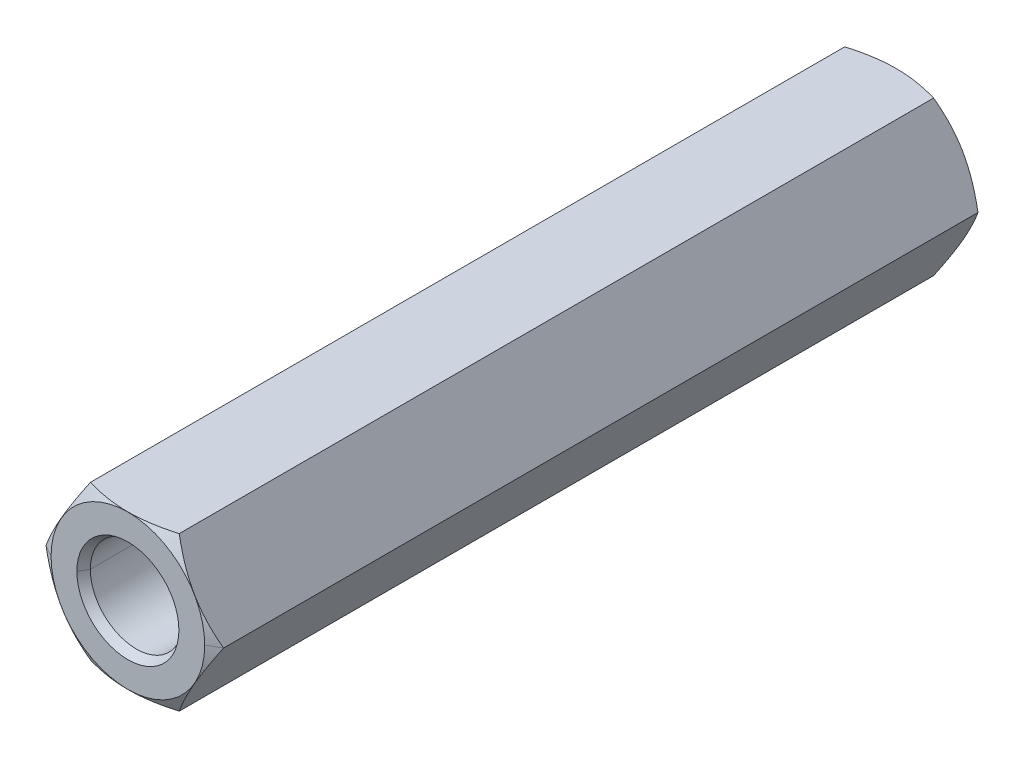
ISO-10303-21;
HEADER;
FILE_DESCRIPTION(('STEP AP214'),'2;1');
FILE_NAME('part.step','',(''),(''),'','','');
FILE_SCHEMA(('AUTOMOTIVE_DESIGN { 1 0 10303 214 1 1 1 1 }'));
ENDSEC;
DATA;
#1=APPLICATION_CONTEXT('core data for automotive mechanical design processes');
#2=APPLICATION_PROTOCOL_DEFINITION('international standard','automotive_design',2000,#1);
#3=PRODUCT_CONTEXT('',#1,'mechanical');
#4=PRODUCT('Part','Part','',(#3));
#5=PRODUCT_RELATED_PRODUCT_CATEGORY('part','',(#4));
#6=PRODUCT_DEFINITION_FORMATION('','',#4);
#7=PRODUCT_DEFINITION_CONTEXT('part definition',#1,'design');
#8=PRODUCT_DEFINITION('design','',#6,#7);
#9=PRODUCT_DEFINITION_SHAPE('','',#8);
#10=(LENGTH_UNIT() NAMED_UNIT(*) SI_UNIT(.MILLI.,.METRE.));
#11=(NAMED_UNIT(*) PLANE_ANGLE_UNIT() SI_UNIT($,.RADIAN.));
#12=(NAMED_UNIT(*) SI_UNIT($,.STERADIAN.) SOLID_ANGLE_UNIT());
#13=UNCERTAINTY_MEASURE_WITH_UNIT(LENGTH_MEASURE(1.E-05),#10,'distance_accuracy_value','');
#14=(GEOMETRIC_REPRESENTATION_CONTEXT(3) GLOBAL_UNCERTAINTY_ASSIGNED_CONTEXT((#13)) GLOBAL_UNIT_ASSIGNED_CONTEXT((#10,
#11,#12)) REPRESENTATION_CONTEXT('',''));
#15=CARTESIAN_POINT('',(0.,0.,0.));
#16=DIRECTION('',(0.,0.,1.));
#17=DIRECTION('',(1.,0.,0.));
#18=AXIS2_PLACEMENT_3D('',#15,#16,#17);
#19=CARTESIAN_POINT('',(116.318744279938,82.5620432923505,125.715557504815));
#20=DIRECTION('',(0.,0.,1.));
#21=DIRECTION('',(-1.,0.,0.));
#22=AXIS2_PLACEMENT_3D('',#19,#20,#21);
#23=CONICAL_SURFACE('',#22,1.73205080757048,1.047197551197);
#24=DIRECTION('',(-0.86602540378464,0.,0.499999999999652));
#25=VECTOR('',#24,1.);
#26=CARTESIAN_POINT('',(114.586693472367,82.5620432923505,125.715557504815));
#27=LINE('',#26,#25);
#28=CARTESIAN_POINT('',(116.318744279938,82.5620432923505,124.715557504815));
#29=VERTEX_POINT('',#28);
#30=CARTESIAN_POINT('',(114.818744279938,82.5620432923505,125.581582908599));
#31=VERTEX_POINT('',#30);
#32=EDGE_CURVE('E67',#29,#31,#27,.T.);
#33=ORIENTED_EDGE('',*,*,#32,.F.);
#34=DIRECTION('',(0.86602540378464,0.,0.499999999999652));
#35=VECTOR('',#34,1.);
#36=CARTESIAN_POINT('',(118.050795087508,82.5620432923505,125.715557504815));
#37=LINE('',#36,#35);
#38=CARTESIAN_POINT('',(117.818744279938,82.5620432923505,125.581582908599));
#39=VERTEX_POINT('',#38);
#40=EDGE_CURVE('E11',#29,#39,#37,.T.);
#41=ORIENTED_EDGE('',*,*,#40,.T.);
#42=CARTESIAN_POINT('',(116.318744279938,82.5620432923505,125.581582908599));
#43=DIRECTION('',(0.,0.,-1.));
#44=DIRECTION('',(-1.,0.,0.));
#45=AXIS2_PLACEMENT_3D('',#42,#43,#44);
#46=CIRCLE('',#45,1.5);
#47=EDGE_CURVE('E55',#31,#39,#46,.T.);
#48=ORIENTED_EDGE('',*,*,#47,.F.);
#49=EDGE_LOOP('',(#33,#41,#48));
#50=FACE_BOUND('',#49,.T.);
#51=ADVANCED_FACE('F44',(#50),#23,.F.);
#52=CARTESIAN_POINT('',(116.318744279938,82.5620432923505,125.581582908599));
#53=DIRECTION('',(0.,0.,1.));
#54=DIRECTION('',(-1.,0.,0.));
#55=AXIS2_PLACEMENT_3D('',#52,#53,#54);
#56=CYLINDRICAL_SURFACE('',#55,1.5);
#57=ORIENTED_EDGE('',*,*,#47,.T.);
#58=DIRECTION('',(0.,0.,1.));
#59=VECTOR('',#58,1.);
#60=CARTESIAN_POINT('',(117.818744279938,82.5620432923505,125.581582908599));
#61=LINE('',#60,#59);
#62=CARTESIAN_POINT('',(117.818744279938,82.5620432923505,135.304454779389));
#63=VERTEX_POINT('',#62);
#64=EDGE_CURVE('E209',#39,#63,#61,.T.);
#65=ORIENTED_EDGE('',*,*,#64,.T.);
#66=CARTESIAN_POINT('',(116.318744279938,82.5620432923505,135.304454779389));
#67=DIRECTION('',(0.,0.,-1.));
#68=DIRECTION('',(-1.,0.,0.));
#69=AXIS2_PLACEMENT_3D('',#66,#67,#68);
#70=CIRCLE('',#69,1.5);
#71=CARTESIAN_POINT('',(114.818744279938,82.5620432923505,135.304454779389));
#72=VERTEX_POINT('',#71);
#73=EDGE_CURVE('E187',#72,#63,#70,.T.);
#74=ORIENTED_EDGE('',*,*,#73,.F.);
#75=DIRECTION('',(0.,0.,1.));
#76=VECTOR('',#75,1.);
#77=CARTESIAN_POINT('',(114.818744279938,82.5620432923505,125.581582908599));
#78=LINE('',#77,#76);
#79=EDGE_CURVE('E277',#31,#72,#78,.T.);
#80=ORIENTED_EDGE('',*,*,#79,.F.);
#81=EDGE_LOOP('',(#57,#65,#74,#80));
#82=FACE_BOUND('',#81,.T.);
#83=ADVANCED_FACE('F466',(#82),#56,.F.);
#84=CARTESIAN_POINT('',(116.318744279938,82.5620432923505,135.304454779389));
#85=DIRECTION('',(0.,0.,1.));
#86=DIRECTION('',(-1.,0.,0.));
#87=AXIS2_PLACEMENT_3D('',#84,#85,#86);
#88=CONICAL_SURFACE('',#87,1.5,0.5235987756);
#89=ORIENTED_EDGE('',*,*,#73,.T.);
#90=DIRECTION('',(0.500000000001473,0.,0.866025403783588));
#91=VECTOR('',#90,1.);
#92=CARTESIAN_POINT('',(117.818744279938,82.5620432923505,135.304454779389));
#93=LINE('',#92,#91);
#94=CARTESIAN_POINT('',(117.978744279938,82.5620432923505,135.581582908599));
#95=VERTEX_POINT('',#94);
#96=EDGE_CURVE('E184',#63,#95,#93,.T.);
#97=ORIENTED_EDGE('',*,*,#96,.T.);
#98=CARTESIAN_POINT('',(116.318744279938,82.5620432923505,135.581582908599));
#99=DIRECTION('',(0.,0.,-1.));
#100=DIRECTION('',(-1.,0.,0.));
#101=AXIS2_PLACEMENT_3D('',#98,#99,#100);
#102=CIRCLE('',#101,1.66);
#103=CARTESIAN_POINT('',(114.658744279938,82.5620432923505,135.581582908599));
#104=VERTEX_POINT('',#103);
#105=EDGE_CURVE('E173',#104,#95,#102,.T.);
#106=ORIENTED_EDGE('',*,*,#105,.F.);
#107=DIRECTION('',(-0.500000000001473,0.,0.866025403783588));
#108=VECTOR('',#107,1.);
#109=CARTESIAN_POINT('',(114.818744279938,82.5620432923505,135.304454779389));
#110=LINE('',#109,#108);
#111=EDGE_CURVE('E195',#72,#104,#110,.T.);
#112=ORIENTED_EDGE('',*,*,#111,.F.);
#113=EDGE_LOOP('',(#89,#97,#106,#112));
#114=FACE_BOUND('',#113,.T.);
#115=ADVANCED_FACE('F185',(#114),#88,.F.);
#116=CARTESIAN_POINT('',(116.318744279938,82.5620432923505,135.581582908599));
#117=DIRECTION('',(0.,0.,-1.));
#118=DIRECTION('',(-1.,0.,0.));
#119=AXIS2_PLACEMENT_3D('',#116,#117,#118);
#120=CONICAL_SURFACE('',#119,2.5,1.047197551197);
#121=CARTESIAN_POINT('',(116.318744279938,82.5620432923505,135.581582908599));
#122=DIRECTION('',(0.,0.,-1.));
#123=DIRECTION('',(-1.,0.,0.));
#124=AXIS2_PLACEMENT_3D('',#121,#122,#123);
#125=CIRCLE('',#124,2.5);
#126=CARTESIAN_POINT('',(113.818744279938,82.5620432923505,135.581582908599));
#127=VERTEX_POINT('',#126);
#128=CARTESIAN_POINT('',(118.818744279938,82.5620432923505,135.581582908599));
#129=VERTEX_POINT('',#128);
#130=EDGE_CURVE('E192',#127,#129,#125,.T.);
#131=ORIENTED_EDGE('',*,*,#130,.T.);
#132=DIRECTION('',(0.86602540378464,0.,-0.499999999999652));
#133=VECTOR('',#132,1.);
#134=CARTESIAN_POINT('',(118.818744279938,82.5620432923505,135.581582908599));
#135=LINE('',#134,#133);
#136=CARTESIAN_POINT('',(119.208744279938,82.5620432923505,135.356416303615));
#137=VERTEX_POINT('',#136);
#138=EDGE_CURVE('E301',#129,#137,#135,.T.);
#139=ORIENTED_EDGE('',*,*,#138,.T.);
#140=CARTESIAN_POINT('',(117.763744279938,85.0648567092876,135.356416303615));
#141=CARTESIAN_POINT('',(118.486244279938,83.8134500008194,135.773551873104));
#142=CARTESIAN_POINT('',(119.208744279938,82.5620432923505,135.356416303615));
#143=(BOUNDED_CURVE() B_SPLINE_CURVE(2,(#140,#141,#142),.UNSPECIFIED.,.F.,
.F.) B_SPLINE_CURVE_WITH_KNOTS((3,3),(0.,1.),
.UNSPECIFIED.) CURVE() GEOMETRIC_REPRESENTATION_ITEM() RATIONAL_B_SPLINE_CURVE((1.,
1.15470053837935,1.)) REPRESENTATION_ITEM(''));
#144=CARTESIAN_POINT('',(117.763744279938,85.0648567092876,135.356416303615));
#145=VERTEX_POINT('',#144);
#146=EDGE_CURVE('E276',#145,#137,#143,.T.);
#147=ORIENTED_EDGE('',*,*,#146,.F.);
#148=CARTESIAN_POINT('',(114.873744279938,85.0648567092876,135.356416303615));
#149=CARTESIAN_POINT('',(116.318744279938,85.0648567092875,135.773551873104));
#150=CARTESIAN_POINT('',(117.763744279938,85.0648567092876,135.356416303615));
#151=(BOUNDED_CURVE() B_SPLINE_CURVE(2,(#148,#149,#150),.UNSPECIFIED.,.F.,
.F.) B_SPLINE_CURVE_WITH_KNOTS((3,3),(0.,1.),
.UNSPECIFIED.) CURVE() GEOMETRIC_REPRESENTATION_ITEM() RATIONAL_B_SPLINE_CURVE((1.,
1.15470053837926,1.)) REPRESENTATION_ITEM(''));
#152=CARTESIAN_POINT('',(114.873744279938,85.0648567092876,135.356416303615));
#153=VERTEX_POINT('',#152);
#154=EDGE_CURVE('E316',#153,#145,#151,.T.);
#155=ORIENTED_EDGE('',*,*,#154,.F.);
#156=CARTESIAN_POINT('',(113.428744279938,82.5620432923505,135.356416303615));
#157=CARTESIAN_POINT('',(114.151244279937,83.8134500008189,135.773551873104));
#158=CARTESIAN_POINT('',(114.873744279938,85.0648567092876,135.356416303615));
#159=(BOUNDED_CURVE() B_SPLINE_CURVE(2,(#156,#157,#158),.UNSPECIFIED.,.F.,
.F.) B_SPLINE_CURVE_WITH_KNOTS((3,3),(0.,1.),
.UNSPECIFIED.) CURVE() GEOMETRIC_REPRESENTATION_ITEM() RATIONAL_B_SPLINE_CURVE((1.,
1.15470053837946,1.)) REPRESENTATION_ITEM(''));
#160=CARTESIAN_POINT('',(113.428744279938,82.5620432923505,135.356416303615));
#161=VERTEX_POINT('',#160);
#162=EDGE_CURVE('E259',#161,#153,#159,.T.);
#163=ORIENTED_EDGE('',*,*,#162,.F.);
#164=DIRECTION('',(-0.86602540378464,0.,-0.499999999999652));
#165=VECTOR('',#164,1.);
#166=CARTESIAN_POINT('',(113.818744279938,82.5620432923505,135.581582908599));
#167=LINE('',#166,#165);
#168=EDGE_CURVE('E181',#127,#161,#167,.T.);
#169=ORIENTED_EDGE('',*,*,#168,.F.);
#170=EDGE_LOOP('',(#131,#139,#147,#155,#163,#169));
#171=FACE_BOUND('',#170,.T.);
#172=ADVANCED_FACE('F512',(#171),#120,.T.);
#173=CARTESIAN_POINT('',(116.318744279938,82.5620432923505,110.806749513583));
#174=DIRECTION('',(0.,0.,1.));
#175=DIRECTION('',(-1.,0.,0.));
#176=AXIS2_PLACEMENT_3D('',#173,#174,#175);
#177=CONICAL_SURFACE('',#176,2.89,1.047197551197);
#178=CARTESIAN_POINT('',(116.318744279938,82.5620432923505,110.581582908599));
#179=DIRECTION('',(0.,0.,-1.));
#180=DIRECTION('',(-1.,0.,0.));
#181=AXIS2_PLACEMENT_3D('',#178,#179,#180);
#182=CIRCLE('',#181,2.5);
#183=CARTESIAN_POINT('',(118.818744279938,82.5620432923505,110.581582908599));
#184=VERTEX_POINT('',#183);
#185=CARTESIAN_POINT('',(113.818744279938,82.5620432923505,110.581582908599));
#186=VERTEX_POINT('',#185);
#187=EDGE_CURVE('E243',#184,#186,#182,.T.);
#188=ORIENTED_EDGE('',*,*,#187,.F.);
#189=DIRECTION('',(0.86602540378464,0.,0.499999999999652));
#190=VECTOR('',#189,1.);
#191=CARTESIAN_POINT('',(119.208744279938,82.5620432923505,110.806749513583));
#192=LINE('',#191,#190);
#193=CARTESIAN_POINT('',(119.208744279938,82.5620432923506,110.806749513583));
#194=VERTEX_POINT('',#193);
#195=EDGE_CURVE('E297',#184,#194,#192,.T.);
#196=ORIENTED_EDGE('',*,*,#195,.T.);
#197=CARTESIAN_POINT('',(117.763744279938,80.0592298754135,110.806749513583));
#198=CARTESIAN_POINT('',(118.486244279938,81.3106365838816,110.389613944093));
#199=CARTESIAN_POINT('',(119.208744279938,82.5620432923506,110.806749513583));
#200=(BOUNDED_CURVE() B_SPLINE_CURVE(2,(#197,#198,#199),.UNSPECIFIED.,.F.,
.F.) B_SPLINE_CURVE_WITH_KNOTS((3,3),(0.,1.),
.UNSPECIFIED.) CURVE() GEOMETRIC_REPRESENTATION_ITEM() RATIONAL_B_SPLINE_CURVE((1.,
1.15470053837936,1.)) REPRESENTATION_ITEM(''));
#201=CARTESIAN_POINT('',(117.763744279938,80.0592298754135,110.806749513583));
#202=VERTEX_POINT('',#201);
#203=EDGE_CURVE('E284',#202,#194,#200,.T.);
#204=ORIENTED_EDGE('',*,*,#203,.F.);
#205=CARTESIAN_POINT('',(114.873744279938,80.0592298754135,110.806749513583));
#206=CARTESIAN_POINT('',(116.318744279938,80.0592298754135,110.389613944093));
#207=CARTESIAN_POINT('',(117.763744279938,80.0592298754135,110.806749513583));
#208=(BOUNDED_CURVE() B_SPLINE_CURVE(2,(#205,#206,#207),.UNSPECIFIED.,.F.,
.F.) B_SPLINE_CURVE_WITH_KNOTS((3,3),(0.,1.),
.UNSPECIFIED.) CURVE() GEOMETRIC_REPRESENTATION_ITEM() RATIONAL_B_SPLINE_CURVE((1.,
1.15470053837925,1.)) REPRESENTATION_ITEM(''));
#209=CARTESIAN_POINT('',(114.873744279938,80.0592298754135,110.806749513583));
#210=VERTEX_POINT('',#209);
#211=EDGE_CURVE('E222',#210,#202,#208,.T.);
#212=ORIENTED_EDGE('',*,*,#211,.F.);
#213=CARTESIAN_POINT('',(113.428744279938,82.5620432923505,110.806749513583));
#214=CARTESIAN_POINT('',(114.151244279937,81.3106365838822,110.389613944093));
#215=CARTESIAN_POINT('',(114.873744279938,80.0592298754135,110.806749513583));
#216=(BOUNDED_CURVE() B_SPLINE_CURVE(2,(#213,#214,#215),.UNSPECIFIED.,.F.,
.F.) B_SPLINE_CURVE_WITH_KNOTS((3,3),(0.,1.),
.UNSPECIFIED.) CURVE() GEOMETRIC_REPRESENTATION_ITEM() RATIONAL_B_SPLINE_CURVE((1.,
1.15470053837944,1.)) REPRESENTATION_ITEM(''));
#217=CARTESIAN_POINT('',(113.428744279938,82.5620432923505,110.806749513583));
#218=VERTEX_POINT('',#217);
#219=EDGE_CURVE('E238',#218,#210,#216,.T.);
#220=ORIENTED_EDGE('',*,*,#219,.F.);
#221=DIRECTION('',(-0.86602540378464,0.,0.499999999999652));
#222=VECTOR('',#221,1.);
#223=CARTESIAN_POINT('',(113.428744279938,82.5620432923505,110.806749513583));
#224=LINE('',#223,#222);
#225=EDGE_CURVE('E237',#186,#218,#224,.T.);
#226=ORIENTED_EDGE('',*,*,#225,.F.);
#227=EDGE_LOOP('',(#188,#196,#204,#212,#220,#226));
#228=FACE_BOUND('',#227,.T.);
#229=ADVANCED_FACE('F500',(#228),#177,.T.);
#230=CARTESIAN_POINT('',(116.318744279938,82.5620432923505,110.581582908599));
#231=DIRECTION('',(0.,0.,-1.));
#232=DIRECTION('',(-1.,0.,0.));
#233=AXIS2_PLACEMENT_3D('',#230,#231,#232);
#234=CONICAL_SURFACE('',#233,1.65999999999899,0.523598775598);
#235=CARTESIAN_POINT('',(116.318744279938,82.5620432923505,110.858711037809));
#236=DIRECTION('',(0.,0.,-1.));
#237=DIRECTION('',(-1.,0.,0.));
#238=AXIS2_PLACEMENT_3D('',#235,#236,#237);
#239=CIRCLE('',#238,1.5);
#240=CARTESIAN_POINT('',(117.818744279938,82.5620432923505,110.858711037809));
#241=VERTEX_POINT('',#240);
#242=CARTESIAN_POINT('',(114.818744279938,82.5620432923505,110.858711037809));
#243=VERTEX_POINT('',#242);
#244=EDGE_CURVE('E253',#241,#243,#239,.T.);
#245=ORIENTED_EDGE('',*,*,#244,.F.);
#246=DIRECTION('',(0.499999999999741,0.,-0.866025403784588));
#247=VECTOR('',#246,1.);
#248=CARTESIAN_POINT('',(117.978744279937,82.5620432923505,110.581582908599));
#249=LINE('',#248,#247);
#250=CARTESIAN_POINT('',(117.978744279937,82.5620432923505,110.581582908599));
#251=VERTEX_POINT('',#250);
#252=EDGE_CURVE('E242',#241,#251,#249,.T.);
#253=ORIENTED_EDGE('',*,*,#252,.T.);
#254=CARTESIAN_POINT('',(116.318744279938,82.5620432923505,110.581582908599));
#255=DIRECTION('',(0.,0.,-1.));
#256=DIRECTION('',(-1.,0.,0.));
#257=AXIS2_PLACEMENT_3D('',#254,#255,#256);
#258=CIRCLE('',#257,1.65999999999899);
#259=CARTESIAN_POINT('',(114.658744279939,82.5620432923505,110.581582908599));
#260=VERTEX_POINT('',#259);
#261=EDGE_CURVE('E232',#251,#260,#258,.T.);
#262=ORIENTED_EDGE('',*,*,#261,.T.);
#263=DIRECTION('',(-0.499999999999741,0.,-0.866025403784588));
#264=VECTOR('',#263,1.);
#265=CARTESIAN_POINT('',(114.658744279939,82.5620432923505,110.581582908599));
#266=LINE('',#265,#264);
#267=EDGE_CURVE('E394',#243,#260,#266,.T.);
#268=ORIENTED_EDGE('',*,*,#267,.F.);
#269=EDGE_LOOP('',(#245,#253,#262,#268));
#270=FACE_BOUND('',#269,.T.);
#271=ADVANCED_FACE('F448',(#270),#234,.F.);
#272=CARTESIAN_POINT('',(116.318744279938,82.5620432923505,110.858711037809));
#273=DIRECTION('',(0.,0.,1.));
#274=DIRECTION('',(-1.,0.,0.));
#275=AXIS2_PLACEMENT_3D('',#272,#273,#274);
#276=CYLINDRICAL_SURFACE('',#275,1.5);
#277=CARTESIAN_POINT('',(116.318744279938,82.5620432923505,110.858711037809));
#278=DIRECTION('',(0.,0.,-1.));
#279=DIRECTION('',(-1.,0.,0.));
#280=AXIS2_PLACEMENT_3D('',#277,#278,#279);
#281=CIRCLE('',#280,1.5);
#282=EDGE_CURVE('E213',#243,#241,#281,.T.);
#283=ORIENTED_EDGE('',*,*,#282,.T.);
#284=DIRECTION('',(0.,0.,1.));
#285=VECTOR('',#284,1.);
#286=CARTESIAN_POINT('',(117.818744279938,82.5620432923505,110.858711037809));
#287=LINE('',#286,#285);
#288=CARTESIAN_POINT('',(117.818744279938,82.5620432923505,120.581582908599));
#289=VERTEX_POINT('',#288);
#290=EDGE_CURVE('E210',#241,#289,#287,.T.);
#291=ORIENTED_EDGE('',*,*,#290,.T.);
#292=CARTESIAN_POINT('',(116.318744279938,82.5620432923505,120.581582908599));
#293=DIRECTION('',(0.,0.,-1.));
#294=DIRECTION('',(-1.,0.,0.));
#295=AXIS2_PLACEMENT_3D('',#292,#293,#294);
#296=CIRCLE('',#295,1.5);
#297=CARTESIAN_POINT('',(114.818744279938,82.5620432923505,120.581582908599));
#298=VERTEX_POINT('',#297);
#299=EDGE_CURVE('E141',#298,#289,#296,.T.);
#300=ORIENTED_EDGE('',*,*,#299,.F.);
#301=DIRECTION('',(0.,0.,1.));
#302=VECTOR('',#301,1.);
#303=CARTESIAN_POINT('',(114.818744279938,82.5620432923505,110.858711037809));
#304=LINE('',#303,#302);
#305=EDGE_CURVE('E156',#243,#298,#304,.T.);
#306=ORIENTED_EDGE('',*,*,#305,.F.);
#307=EDGE_LOOP('',(#283,#291,#300,#306));
#308=FACE_BOUND('',#307,.T.);
#309=ADVANCED_FACE('F499',(#308),#276,.F.);
#310=CARTESIAN_POINT('',(116.318744279938,82.5620432923505,120.581582908599));
#311=DIRECTION('',(0.,0.,-1.));
#312=DIRECTION('',(-1.,0.,0.));
#313=AXIS2_PLACEMENT_3D('',#310,#311,#312);
#314=CONICAL_SURFACE('',#313,1.5,1.047197551197);
#315=DIRECTION('',(-0.86602540378464,0.,-0.499999999999652));
#316=VECTOR('',#315,1.);
#317=CARTESIAN_POINT('',(114.818744279938,82.5620432923505,120.581582908599));
#318=LINE('',#317,#316);
#319=CARTESIAN_POINT('',(116.318744279938,82.5620432923505,121.447608312384));
#320=VERTEX_POINT('',#319);
#321=EDGE_CURVE('E252',#320,#298,#318,.T.);
#322=ORIENTED_EDGE('',*,*,#321,.F.);
#323=DIRECTION('',(0.86602540378464,0.,-0.499999999999652));
#324=VECTOR('',#323,1.);
#325=CARTESIAN_POINT('',(117.818744279938,82.5620432923505,120.581582908599));
#326=LINE('',#325,#324);
#327=EDGE_CURVE('E214',#320,#289,#326,.T.);
#328=ORIENTED_EDGE('',*,*,#327,.T.);
#329=CARTESIAN_POINT('',(116.318744279938,82.5620432923505,120.581582908599));
#330=DIRECTION('',(0.,0.,-1.));
#331=DIRECTION('',(-1.,0.,0.));
#332=AXIS2_PLACEMENT_3D('',#329,#330,#331);
#333=CIRCLE('',#332,1.5);
#334=EDGE_CURVE('E48',#289,#298,#333,.T.);
#335=ORIENTED_EDGE('',*,*,#334,.T.);
#336=EDGE_LOOP('',(#322,#328,#335));
#337=FACE_BOUND('',#336,.T.);
#338=ADVANCED_FACE('F475',(#337),#314,.F.);
#339=CARTESIAN_POINT('',(116.318744279938,82.5620432923505,120.581582908599));
#340=DIRECTION('',(0.,0.,-1.));
#341=DIRECTION('',(-1.,0.,0.));
#342=AXIS2_PLACEMENT_3D('',#339,#340,#341);
#343=CONICAL_SURFACE('',#342,1.5,1.047197551197);
#344=ORIENTED_EDGE('',*,*,#327,.F.);
#345=ORIENTED_EDGE('',*,*,#321,.T.);
#346=ORIENTED_EDGE('',*,*,#299,.T.);
#347=EDGE_LOOP('',(#344,#345,#346));
#348=FACE_BOUND('',#347,.T.);
#349=ADVANCED_FACE('F491',(#348),#343,.F.);
#350=CARTESIAN_POINT('',(116.318744279938,82.5620432923505,110.858711037809));
#351=DIRECTION('',(0.,0.,1.));
#352=DIRECTION('',(-1.,0.,0.));
#353=AXIS2_PLACEMENT_3D('',#350,#351,#352);
#354=CYLINDRICAL_SURFACE('',#353,1.5);
#355=ORIENTED_EDGE('',*,*,#290,.F.);
#356=ORIENTED_EDGE('',*,*,#244,.T.);
#357=ORIENTED_EDGE('',*,*,#305,.T.);
#358=ORIENTED_EDGE('',*,*,#334,.F.);
#359=EDGE_LOOP('',(#355,#356,#357,#358));
#360=FACE_BOUND('',#359,.T.);
#361=ADVANCED_FACE('F462',(#360),#354,.F.);
#362=CARTESIAN_POINT('',(116.318744279938,82.5620432923505,110.581582908599));
#363=DIRECTION('',(0.,0.,-1.));
#364=DIRECTION('',(-1.,0.,0.));
#365=AXIS2_PLACEMENT_3D('',#362,#363,#364);
#366=CONICAL_SURFACE('',#365,1.65999999999899,0.523598775598);
#367=ORIENTED_EDGE('',*,*,#252,.F.);
#368=ORIENTED_EDGE('',*,*,#282,.F.);
#369=ORIENTED_EDGE('',*,*,#267,.T.);
#370=CARTESIAN_POINT('',(116.318744279938,82.5620432923505,110.581582908599));
#371=DIRECTION('',(0.,0.,-1.));
#372=DIRECTION('',(-1.,0.,0.));
#373=AXIS2_PLACEMENT_3D('',#370,#371,#372);
#374=CIRCLE('',#373,1.65999999999899);
#375=EDGE_CURVE('E366',#260,#251,#374,.T.);
#376=ORIENTED_EDGE('',*,*,#375,.T.);
#377=EDGE_LOOP('',(#367,#368,#369,#376));
#378=FACE_BOUND('',#377,.T.);
#379=ADVANCED_FACE('F443',(#378),#366,.F.);
#380=CARTESIAN_POINT('',(116.318744279938,82.5620432923505,110.581582908599));
#381=DIRECTION('',(0.,0.,-1.));
#382=DIRECTION('',(0.,-1.,0.));
#383=AXIS2_PLACEMENT_3D('',#380,#381,#382);
#384=PLANE('',#383);
#385=CARTESIAN_POINT('',(116.318744279938,82.5620432923505,110.581582908599));
#386=DIRECTION('',(0.,0.,-1.));
#387=DIRECTION('',(-1.,0.,0.));
#388=AXIS2_PLACEMENT_3D('',#385,#386,#387);
#389=CIRCLE('',#388,2.5);
#390=EDGE_CURVE('E247',#186,#184,#389,.T.);
#391=ORIENTED_EDGE('',*,*,#390,.T.);
#392=ORIENTED_EDGE('',*,*,#187,.T.);
#393=EDGE_LOOP('',(#391,#392));
#394=FACE_BOUND('',#393,.T.);
#395=ORIENTED_EDGE('',*,*,#375,.F.);
#396=ORIENTED_EDGE('',*,*,#261,.F.);
#397=EDGE_LOOP('',(#395,#396));
#398=FACE_BOUND('',#397,.T.);
#399=ADVANCED_FACE('F450',(#394,#398),#384,.T.);
#400=CARTESIAN_POINT('',(116.318744279938,82.5620432923505,110.806749513583));
#401=DIRECTION('',(0.,0.,1.));
#402=DIRECTION('',(-1.,0.,0.));
#403=AXIS2_PLACEMENT_3D('',#400,#401,#402);
#404=CONICAL_SURFACE('',#403,2.89,1.047197551197);
#405=ORIENTED_EDGE('',*,*,#195,.F.);
#406=ORIENTED_EDGE('',*,*,#390,.F.);
#407=ORIENTED_EDGE('',*,*,#225,.T.);
#408=CARTESIAN_POINT('',(114.873744279938,85.0648567092876,110.806749513583));
#409=CARTESIAN_POINT('',(114.151244279938,83.8134500008194,110.389613944093));
#410=CARTESIAN_POINT('',(113.428744279938,82.5620432923505,110.806749513583));
#411=(BOUNDED_CURVE() B_SPLINE_CURVE(2,(#408,#409,#410),.UNSPECIFIED.,.F.,
.F.) B_SPLINE_CURVE_WITH_KNOTS((3,3),(0.,1.),
.UNSPECIFIED.) CURVE() GEOMETRIC_REPRESENTATION_ITEM() RATIONAL_B_SPLINE_CURVE((1.,
1.15470053837935,1.)) REPRESENTATION_ITEM(''));
#412=CARTESIAN_POINT('',(114.873744279938,85.0648567092876,110.806749513583));
#413=VERTEX_POINT('',#412);
#414=EDGE_CURVE('E264',#413,#218,#411,.T.);
#415=ORIENTED_EDGE('',*,*,#414,.F.);
#416=CARTESIAN_POINT('',(117.763744279938,85.0648567092876,110.806749513583));
#417=CARTESIAN_POINT('',(116.318744279938,85.0648567092875,110.389613944093));
#418=CARTESIAN_POINT('',(114.873744279938,85.0648567092876,110.806749513583));
#419=(BOUNDED_CURVE() B_SPLINE_CURVE(2,(#416,#417,#418),.UNSPECIFIED.,.F.,
.F.) B_SPLINE_CURVE_WITH_KNOTS((3,3),(0.,1.),
.UNSPECIFIED.) CURVE() GEOMETRIC_REPRESENTATION_ITEM() RATIONAL_B_SPLINE_CURVE((1.,
1.15470053837925,1.)) REPRESENTATION_ITEM(''));
#420=CARTESIAN_POINT('',(117.763744279938,85.0648567092876,110.806749513583));
#421=VERTEX_POINT('',#420);
#422=EDGE_CURVE('E322',#421,#413,#419,.T.);
#423=ORIENTED_EDGE('',*,*,#422,.F.);
#424=CARTESIAN_POINT('',(119.208744279938,82.5620432923506,110.806749513583));
#425=CARTESIAN_POINT('',(118.486244279938,83.8134500008189,110.389613944093));
#426=CARTESIAN_POINT('',(117.763744279938,85.0648567092876,110.806749513583));
#427=(BOUNDED_CURVE() B_SPLINE_CURVE(2,(#424,#425,#426),.UNSPECIFIED.,.F.,
.F.) B_SPLINE_CURVE_WITH_KNOTS((3,3),(0.,1.),
.UNSPECIFIED.) CURVE() GEOMETRIC_REPRESENTATION_ITEM() RATIONAL_B_SPLINE_CURVE((1.,
1.15470053837944,1.)) REPRESENTATION_ITEM(''));
#428=EDGE_CURVE('E266',#194,#421,#427,.T.);
#429=ORIENTED_EDGE('',*,*,#428,.F.);
#430=EDGE_LOOP('',(#405,#406,#407,#415,#423,#429));
#431=FACE_BOUND('',#430,.T.);
#432=ADVANCED_FACE('F452',(#431),#404,.T.);
#433=CARTESIAN_POINT('',(114.873744279938,80.0592298754135,135.581582908599));
#434=DIRECTION('',(0.866025403784329,0.50000000000019,0.));
#435=DIRECTION('',(0.,0.,-1.));
#436=AXIS2_PLACEMENT_3D('',#433,#434,#435);
#437=PLANE('',#436);
#438=DIRECTION('',(0.,0.,-1.));
#439=VECTOR('',#438,1.);
#440=CARTESIAN_POINT('',(113.428744279938,82.5620432923505,135.356416303615));
#441=LINE('',#440,#439);
#442=EDGE_CURVE('E233',#161,#218,#441,.T.);
#443=ORIENTED_EDGE('',*,*,#442,.T.);
#444=ORIENTED_EDGE('',*,*,#219,.T.);
#445=DIRECTION('',(0.,0.,-1.));
#446=VECTOR('',#445,1.);
#447=CARTESIAN_POINT('',(114.873744279938,80.0592298754135,135.581582908599));
#448=LINE('',#447,#446);
#449=CARTESIAN_POINT('',(114.873744279938,80.0592298754135,135.356416303615));
#450=VERTEX_POINT('',#449);
#451=EDGE_CURVE('E254',#450,#210,#448,.T.);
#452=ORIENTED_EDGE('',*,*,#451,.F.);
#453=CARTESIAN_POINT('',(114.873744279938,80.0592298754135,135.356416303615));
#454=CARTESIAN_POINT('',(114.151244279938,81.3106365838817,135.773551873104));
#455=CARTESIAN_POINT('',(113.428744279938,82.5620432923505,135.356416303615));
#456=(BOUNDED_CURVE() B_SPLINE_CURVE(2,(#453,#454,#455),.UNSPECIFIED.,.F.,
.F.) B_SPLINE_CURVE_WITH_KNOTS((3,3),(0.,1.),
.UNSPECIFIED.) CURVE() GEOMETRIC_REPRESENTATION_ITEM() RATIONAL_B_SPLINE_CURVE((1.,
1.15470053837935,1.)) REPRESENTATION_ITEM(''));
#457=EDGE_CURVE('E258',#450,#161,#456,.T.);
#458=ORIENTED_EDGE('',*,*,#457,.T.);
#459=EDGE_LOOP('',(#443,#444,#452,#458));
#460=FACE_BOUND('',#459,.T.);
#461=ADVANCED_FACE('F459',(#460),#437,.F.);
#462=CARTESIAN_POINT('',(117.763744279938,80.0592298754135,135.581582908599));
#463=DIRECTION('',(0.,1.,0.));
#464=DIRECTION('',(1.,0.,0.));
#465=AXIS2_PLACEMENT_3D('',#462,#463,#464);
#466=PLANE('',#465);
#467=ORIENTED_EDGE('',*,*,#451,.T.);
#468=ORIENTED_EDGE('',*,*,#211,.T.);
#469=DIRECTION('',(0.,0.,-1.));
#470=VECTOR('',#469,1.);
#471=CARTESIAN_POINT('',(117.763744279938,80.0592298754135,135.581582908599));
#472=LINE('',#471,#470);
#473=CARTESIAN_POINT('',(117.763744279938,80.0592298754135,135.356416303615));
#474=VERTEX_POINT('',#473);
#475=EDGE_CURVE('E223',#474,#202,#472,.T.);
#476=ORIENTED_EDGE('',*,*,#475,.F.);
#477=CARTESIAN_POINT('',(117.763744279938,80.0592298754135,135.356416303615));
#478=CARTESIAN_POINT('',(116.318744279938,80.0592298754135,135.773551873104));
#479=CARTESIAN_POINT('',(114.873744279938,80.0592298754135,135.356416303615));
#480=(BOUNDED_CURVE() B_SPLINE_CURVE(2,(#477,#478,#479),.UNSPECIFIED.,.F.,
.F.) B_SPLINE_CURVE_WITH_KNOTS((3,3),(0.,1.),
.UNSPECIFIED.) CURVE() GEOMETRIC_REPRESENTATION_ITEM() RATIONAL_B_SPLINE_CURVE((1.,
1.15470053837926,1.)) REPRESENTATION_ITEM(''));
#481=EDGE_CURVE('E216',#474,#450,#480,.T.);
#482=ORIENTED_EDGE('',*,*,#481,.T.);
#483=EDGE_LOOP('',(#467,#468,#476,#482));
#484=FACE_BOUND('',#483,.T.);
#485=ADVANCED_FACE('F485',(#484),#466,.F.);
#486=CARTESIAN_POINT('',(119.208744279938,82.5620432923505,135.581582908599));
#487=DIRECTION('',(-0.866025403784329,0.50000000000019,0.));
#488=DIRECTION('',(0.,0.,1.));
#489=AXIS2_PLACEMENT_3D('',#486,#487,#488);
#490=PLANE('',#489);
#491=ORIENTED_EDGE('',*,*,#475,.T.);
#492=ORIENTED_EDGE('',*,*,#203,.T.);
#493=DIRECTION('',(0.,0.,-1.));
#494=VECTOR('',#493,1.);
#495=CARTESIAN_POINT('',(119.208744279938,82.5620432923505,135.581582908599));
#496=LINE('',#495,#494);
#497=EDGE_CURVE('E275',#137,#194,#496,.T.);
#498=ORIENTED_EDGE('',*,*,#497,.F.);
#499=CARTESIAN_POINT('',(119.208744279938,82.5620432923505,135.356416303615));
#500=CARTESIAN_POINT('',(118.486244279938,81.3106365838822,135.773551873105));
#501=CARTESIAN_POINT('',(117.763744279938,80.0592298754135,135.356416303615));
#502=(BOUNDED_CURVE() B_SPLINE_CURVE(2,(#499,#500,#501),.UNSPECIFIED.,.F.,
.F.) B_SPLINE_CURVE_WITH_KNOTS((3,3),(0.,1.),
.UNSPECIFIED.) CURVE() GEOMETRIC_REPRESENTATION_ITEM() RATIONAL_B_SPLINE_CURVE((1.,
1.15470053837945,1.)) REPRESENTATION_ITEM(''));
#503=EDGE_CURVE('E290',#137,#474,#502,.T.);
#504=ORIENTED_EDGE('',*,*,#503,.T.);
#505=EDGE_LOOP('',(#491,#492,#498,#504));
#506=FACE_BOUND('',#505,.T.);
#507=ADVANCED_FACE('F481',(#506),#490,.F.);
#508=CARTESIAN_POINT('',(117.763744279938,85.0648567092876,135.581582908599));
#509=DIRECTION('',(-0.866025403784329,-0.50000000000019,0.));
#510=DIRECTION('',(-0.50000000000019,0.866025403784329,0.));
#511=AXIS2_PLACEMENT_3D('',#508,#509,#510);
#512=PLANE('',#511);
#513=ORIENTED_EDGE('',*,*,#497,.T.);
#514=ORIENTED_EDGE('',*,*,#428,.T.);
#515=DIRECTION('',(0.,0.,-1.));
#516=VECTOR('',#515,1.);
#517=CARTESIAN_POINT('',(117.763744279938,85.0648567092876,135.581582908599));
#518=LINE('',#517,#516);
#519=EDGE_CURVE('E359',#145,#421,#518,.T.);
#520=ORIENTED_EDGE('',*,*,#519,.F.);
#521=ORIENTED_EDGE('',*,*,#146,.T.);
#522=EDGE_LOOP('',(#513,#514,#520,#521));
#523=FACE_BOUND('',#522,.T.);
#524=ADVANCED_FACE('F484',(#523),#512,.F.);
#525=CARTESIAN_POINT('',(114.873744279938,85.0648567092876,135.581582908599));
#526=DIRECTION('',(0.,-1.,0.));
#527=DIRECTION('',(0.,0.,-1.));
#528=AXIS2_PLACEMENT_3D('',#525,#526,#527);
#529=PLANE('',#528);
#530=ORIENTED_EDGE('',*,*,#519,.T.);
#531=ORIENTED_EDGE('',*,*,#422,.T.);
#532=DIRECTION('',(0.,0.,-1.));
#533=VECTOR('',#532,1.);
#534=CARTESIAN_POINT('',(114.873744279938,85.0648567092876,135.581582908599));
#535=LINE('',#534,#533);
#536=EDGE_CURVE('E323',#153,#413,#535,.T.);
#537=ORIENTED_EDGE('',*,*,#536,.F.);
#538=ORIENTED_EDGE('',*,*,#154,.T.);
#539=EDGE_LOOP('',(#530,#531,#537,#538));
#540=FACE_BOUND('',#539,.T.);
#541=ADVANCED_FACE('F46',(#540),#529,.F.);
#542=CARTESIAN_POINT('',(113.428744279938,82.5620432923505,135.581582908599));
#543=DIRECTION('',(0.866025403784329,-0.50000000000019,0.));
#544=DIRECTION('',(0.,0.,-1.));
#545=AXIS2_PLACEMENT_3D('',#542,#543,#544);
#546=PLANE('',#545);
#547=ORIENTED_EDGE('',*,*,#536,.T.);
#548=ORIENTED_EDGE('',*,*,#414,.T.);
#549=ORIENTED_EDGE('',*,*,#442,.F.);
#550=ORIENTED_EDGE('',*,*,#162,.T.);
#551=EDGE_LOOP('',(#547,#548,#549,#550));
#552=FACE_BOUND('',#551,.T.);
#553=ADVANCED_FACE('F477',(#552),#546,.F.);
#554=CARTESIAN_POINT('',(116.318744279938,82.5620432923505,135.581582908599));
#555=DIRECTION('',(0.,0.,-1.));
#556=DIRECTION('',(-1.,0.,0.));
#557=AXIS2_PLACEMENT_3D('',#554,#555,#556);
#558=CONICAL_SURFACE('',#557,2.5,1.047197551197);
#559=ORIENTED_EDGE('',*,*,#138,.F.);
#560=CARTESIAN_POINT('',(116.318744279938,82.5620432923505,135.581582908599));
#561=DIRECTION('',(0.,0.,-1.));
#562=DIRECTION('',(-1.,0.,0.));
#563=AXIS2_PLACEMENT_3D('',#560,#561,#562);
#564=CIRCLE('',#563,2.5);
#565=EDGE_CURVE('E265',#129,#127,#564,.T.);
#566=ORIENTED_EDGE('',*,*,#565,.T.);
#567=ORIENTED_EDGE('',*,*,#168,.T.);
#568=ORIENTED_EDGE('',*,*,#457,.F.);
#569=ORIENTED_EDGE('',*,*,#481,.F.);
#570=ORIENTED_EDGE('',*,*,#503,.F.);
#571=EDGE_LOOP('',(#559,#566,#567,#568,#569,#570));
#572=FACE_BOUND('',#571,.T.);
#573=ADVANCED_FACE('F480',(#572),#558,.T.);
#574=CARTESIAN_POINT('',(116.318744279938,82.5620432923505,135.581582908599));
#575=DIRECTION('',(0.,0.,-1.));
#576=DIRECTION('',(0.,-1.,0.));
#577=AXIS2_PLACEMENT_3D('',#574,#575,#576);
#578=PLANE('',#577);
#579=ORIENTED_EDGE('',*,*,#130,.F.);
#580=ORIENTED_EDGE('',*,*,#565,.F.);
#581=EDGE_LOOP('',(#579,#580));
#582=FACE_BOUND('',#581,.T.);
#583=ORIENTED_EDGE('',*,*,#105,.T.);
#584=CARTESIAN_POINT('',(116.318744279938,82.5620432923505,135.581582908599));
#585=DIRECTION('',(0.,0.,-1.));
#586=DIRECTION('',(-1.,0.,0.));
#587=AXIS2_PLACEMENT_3D('',#584,#585,#586);
#588=CIRCLE('',#587,1.66);
#589=EDGE_CURVE('E177',#95,#104,#588,.T.);
#590=ORIENTED_EDGE('',*,*,#589,.T.);
#591=EDGE_LOOP('',(#583,#590));
#592=FACE_BOUND('',#591,.T.);
#593=ADVANCED_FACE('F175',(#582,#592),#578,.F.);
#594=CARTESIAN_POINT('',(116.318744279938,82.5620432923505,135.304454779389));
#595=DIRECTION('',(0.,0.,1.));
#596=DIRECTION('',(-1.,0.,0.));
#597=AXIS2_PLACEMENT_3D('',#594,#595,#596);
#598=CONICAL_SURFACE('',#597,1.5,0.5235987756);
#599=ORIENTED_EDGE('',*,*,#96,.F.);
#600=CARTESIAN_POINT('',(116.318744279938,82.5620432923505,135.304454779389));
#601=DIRECTION('',(0.,0.,-1.));
#602=DIRECTION('',(-1.,0.,0.));
#603=AXIS2_PLACEMENT_3D('',#600,#601,#602);
#604=CIRCLE('',#603,1.5);
#605=EDGE_CURVE('E197',#63,#72,#604,.T.);
#606=ORIENTED_EDGE('',*,*,#605,.T.);
#607=ORIENTED_EDGE('',*,*,#111,.T.);
#608=ORIENTED_EDGE('',*,*,#589,.F.);
#609=EDGE_LOOP('',(#599,#606,#607,#608));
#610=FACE_BOUND('',#609,.T.);
#611=ADVANCED_FACE('F194',(#610),#598,.F.);
#612=CARTESIAN_POINT('',(116.318744279938,82.5620432923505,125.581582908599));
#613=DIRECTION('',(0.,0.,1.));
#614=DIRECTION('',(-1.,0.,0.));
#615=AXIS2_PLACEMENT_3D('',#612,#613,#614);
#616=CYLINDRICAL_SURFACE('',#615,1.5);
#617=ORIENTED_EDGE('',*,*,#64,.F.);
#618=CARTESIAN_POINT('',(116.318744279938,82.5620432923505,125.581582908599));
#619=DIRECTION('',(0.,0.,-1.));
#620=DIRECTION('',(-1.,0.,0.));
#621=AXIS2_PLACEMENT_3D('',#618,#619,#620);
#622=CIRCLE('',#621,1.5);
#623=EDGE_CURVE('E283',#39,#31,#622,.T.);
#624=ORIENTED_EDGE('',*,*,#623,.T.);
#625=ORIENTED_EDGE('',*,*,#79,.T.);
#626=ORIENTED_EDGE('',*,*,#605,.F.);
#627=EDGE_LOOP('',(#617,#624,#625,#626));
#628=FACE_BOUND('',#627,.T.);
#629=ADVANCED_FACE('F492',(#628),#616,.F.);
#630=CARTESIAN_POINT('',(116.318744279938,82.5620432923505,125.715557504815));
#631=DIRECTION('',(0.,0.,1.));
#632=DIRECTION('',(-1.,0.,0.));
#633=AXIS2_PLACEMENT_3D('',#630,#631,#632);
#634=CONICAL_SURFACE('',#633,1.73205080757048,1.047197551197);
#635=ORIENTED_EDGE('',*,*,#40,.F.);
#636=ORIENTED_EDGE('',*,*,#32,.T.);
#637=ORIENTED_EDGE('',*,*,#623,.F.);
#638=EDGE_LOOP('',(#635,#636,#637));
#639=FACE_BOUND('',#638,.T.);
#640=ADVANCED_FACE('F495',(#639),#634,.F.);
#641=CLOSED_SHELL('',(#51,#83,#115,#172,#229,#271,#309,#338,#349,#361,#379,#399,#432,#461,#485,
#507,#524,#541,#553,#573,#593,#611,#629,#640));
#642=MANIFOLD_SOLID_BREP('B2',#641);
#643=ADVANCED_BREP_SHAPE_REPRESENTATION('',(#18,#642),#14);
#644=SHAPE_DEFINITION_REPRESENTATION(#9,#643);
ENDSEC;
END-ISO-10303-21;
